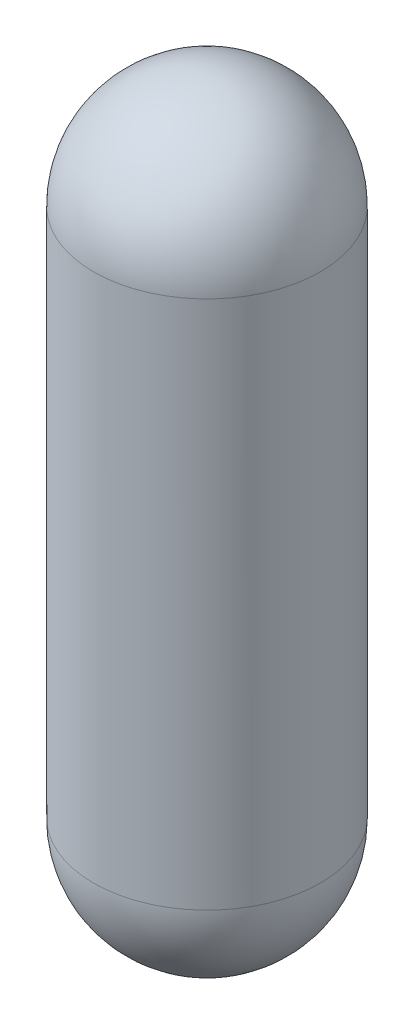
ISO-10303-21;
HEADER;
FILE_DESCRIPTION(('STEP AP214'),'2;1');
FILE_NAME('part.step','',(''),(''),'','','');
FILE_SCHEMA(('AUTOMOTIVE_DESIGN { 1 0 10303 214 1 1 1 1 }'));
ENDSEC;
DATA;
#1=APPLICATION_CONTEXT('core data for automotive mechanical design processes');
#2=APPLICATION_PROTOCOL_DEFINITION('international standard','automotive_design',2000,#1);
#3=PRODUCT_CONTEXT('',#1,'mechanical');
#4=PRODUCT('Part','Part','',(#3));
#5=PRODUCT_RELATED_PRODUCT_CATEGORY('part','',(#4));
#6=PRODUCT_DEFINITION_FORMATION('','',#4);
#7=PRODUCT_DEFINITION_CONTEXT('part definition',#1,'design');
#8=PRODUCT_DEFINITION('design','',#6,#7);
#9=PRODUCT_DEFINITION_SHAPE('','',#8);
#10=(LENGTH_UNIT() NAMED_UNIT(*) SI_UNIT(.MILLI.,.METRE.));
#11=(NAMED_UNIT(*) PLANE_ANGLE_UNIT() SI_UNIT($,.RADIAN.));
#12=(NAMED_UNIT(*) SI_UNIT($,.STERADIAN.) SOLID_ANGLE_UNIT());
#13=UNCERTAINTY_MEASURE_WITH_UNIT(LENGTH_MEASURE(1.E-05),#10,'distance_accuracy_value','');
#14=(GEOMETRIC_REPRESENTATION_CONTEXT(3) GLOBAL_UNCERTAINTY_ASSIGNED_CONTEXT((#13)) GLOBAL_UNIT_ASSIGNED_CONTEXT((#10,
#11,#12)) REPRESENTATION_CONTEXT('',''));
#15=CARTESIAN_POINT('',(0.,0.,0.));
#16=DIRECTION('',(0.,0.,1.));
#17=DIRECTION('',(1.,0.,0.));
#18=AXIS2_PLACEMENT_3D('',#15,#16,#17);
#19=CARTESIAN_POINT('',(0.,17.5,0.));
#20=DIRECTION('',(0.,1.,0.));
#21=DIRECTION('',(1.,0.,0.));
#22=AXIS2_PLACEMENT_3D('',#19,#20,#21);
#23=SPHERICAL_SURFACE('',#22,7.5);
#24=CARTESIAN_POINT('',(0.,17.5,0.));
#25=DIRECTION('',(0.,1.,0.));
#26=DIRECTION('',(0.,0.,1.));
#27=AXIS2_PLACEMENT_3D('',#24,#25,#26);
#28=CIRCLE('',#27,7.5);
#29=CARTESIAN_POINT('',(0.,17.5,7.5));
#30=VERTEX_POINT('',#29);
#31=EDGE_CURVE('E12',#30,#30,#28,.T.);
#32=ORIENTED_EDGE('',*,*,#31,.T.);
#33=EDGE_LOOP('',(#32));
#34=FACE_BOUND('',#33,.T.);
#35=ADVANCED_FACE('F44',(#34),#23,.T.);
#36=CARTESIAN_POINT('',(0.,17.5,0.));
#37=DIRECTION('',(0.,1.,0.));
#38=DIRECTION('',(0.,0.,1.));
#39=AXIS2_PLACEMENT_3D('',#36,#37,#38);
#40=CYLINDRICAL_SURFACE('',#39,7.5);
#41=ORIENTED_EDGE('',*,*,#31,.F.);
#42=EDGE_LOOP('',(#41));
#43=FACE_BOUND('',#42,.T.);
#44=CARTESIAN_POINT('',(0.,-17.5,0.));
#45=DIRECTION('',(0.,1.,0.));
#46=DIRECTION('',(0.,0.,1.));
#47=AXIS2_PLACEMENT_3D('',#44,#45,#46);
#48=CIRCLE('',#47,7.5);
#49=CARTESIAN_POINT('',(0.,-17.5,7.5));
#50=VERTEX_POINT('',#49);
#51=EDGE_CURVE('E50',#50,#50,#48,.T.);
#52=ORIENTED_EDGE('',*,*,#51,.T.);
#53=EDGE_LOOP('',(#52));
#54=FACE_BOUND('',#53,.T.);
#55=ADVANCED_FACE('F56',(#43,#54),#40,.T.);
#56=CARTESIAN_POINT('',(0.,-17.5,0.));
#57=DIRECTION('',(0.,1.,0.));
#58=DIRECTION('',(-1.,0.,0.));
#59=AXIS2_PLACEMENT_3D('',#56,#57,#58);
#60=SPHERICAL_SURFACE('',#59,7.5);
#61=ORIENTED_EDGE('',*,*,#51,.F.);
#62=EDGE_LOOP('',(#61));
#63=FACE_BOUND('',#62,.T.);
#64=ADVANCED_FACE('F58',(#63),#60,.T.);
#65=CLOSED_SHELL('',(#35,#55,#64));
#66=MANIFOLD_SOLID_BREP('B2',#65);
#67=ADVANCED_BREP_SHAPE_REPRESENTATION('',(#18,#66),#14);
#68=SHAPE_DEFINITION_REPRESENTATION(#9,#67);
ENDSEC;
END-ISO-10303-21;
